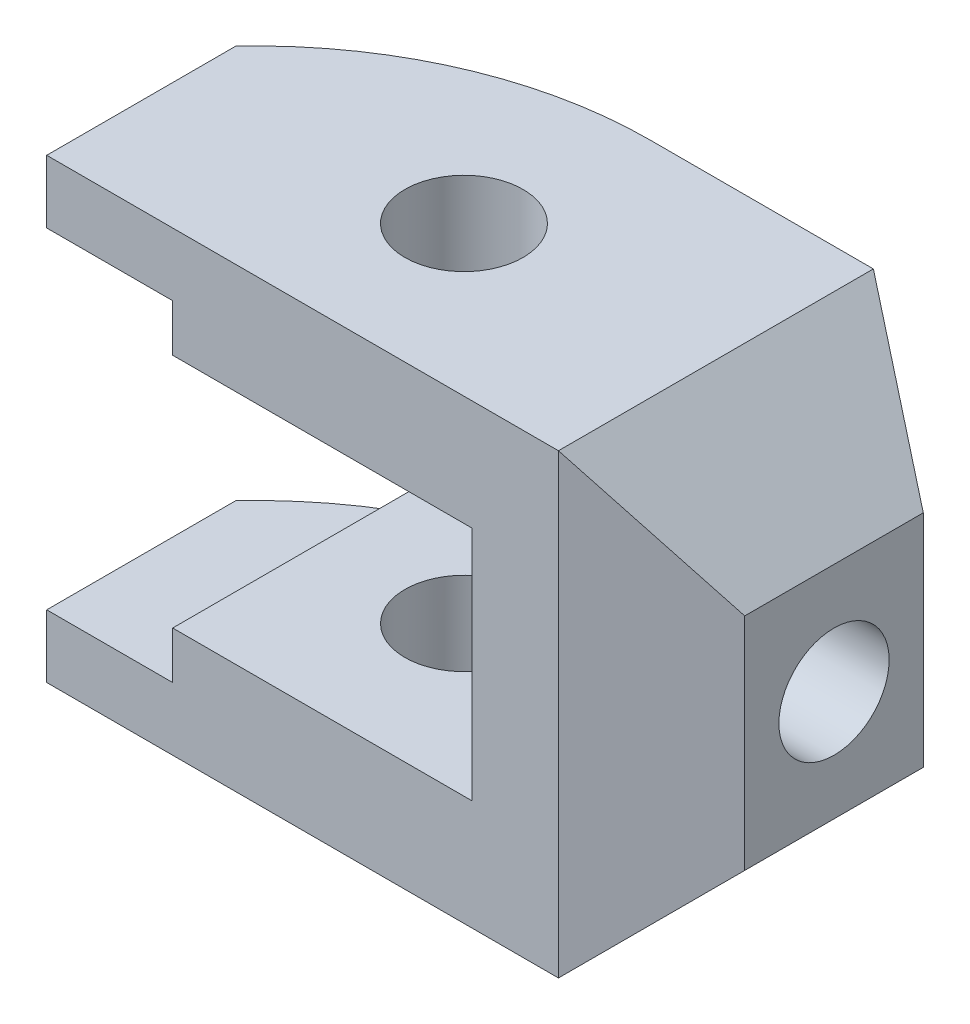
ISO-10303-21;
HEADER;
FILE_DESCRIPTION(('STEP AP214'),'2;1');
FILE_NAME('part.step','',(''),(''),'','','');
FILE_SCHEMA(('AUTOMOTIVE_DESIGN { 1 0 10303 214 1 1 1 1 }'));
ENDSEC;
DATA;
#1=APPLICATION_CONTEXT('core data for automotive mechanical design processes');
#2=APPLICATION_PROTOCOL_DEFINITION('international standard','automotive_design',2000,#1);
#3=PRODUCT_CONTEXT('',#1,'mechanical');
#4=PRODUCT('Part','Part','',(#3));
#5=PRODUCT_RELATED_PRODUCT_CATEGORY('part','',(#4));
#6=PRODUCT_DEFINITION_FORMATION('','',#4);
#7=PRODUCT_DEFINITION_CONTEXT('part definition',#1,'design');
#8=PRODUCT_DEFINITION('design','',#6,#7);
#9=PRODUCT_DEFINITION_SHAPE('','',#8);
#10=(LENGTH_UNIT() NAMED_UNIT(*) SI_UNIT(.MILLI.,.METRE.));
#11=(NAMED_UNIT(*) PLANE_ANGLE_UNIT() SI_UNIT($,.RADIAN.));
#12=(NAMED_UNIT(*) SI_UNIT($,.STERADIAN.) SOLID_ANGLE_UNIT());
#13=UNCERTAINTY_MEASURE_WITH_UNIT(LENGTH_MEASURE(1.E-05),#10,'distance_accuracy_value','');
#14=(GEOMETRIC_REPRESENTATION_CONTEXT(3) GLOBAL_UNCERTAINTY_ASSIGNED_CONTEXT((#13)) GLOBAL_UNIT_ASSIGNED_CONTEXT((#10,
#11,#12)) REPRESENTATION_CONTEXT('',''));
#15=CARTESIAN_POINT('',(0.,0.,0.));
#16=DIRECTION('',(0.,0.,1.));
#17=DIRECTION('',(1.,0.,0.));
#18=AXIS2_PLACEMENT_3D('',#15,#16,#17);
#19=CARTESIAN_POINT('',(2.66060555964672,58.,29.));
#20=DIRECTION('',(0.,-1.,0.));
#21=DIRECTION('',(0.,0.,-1.));
#22=AXIS2_PLACEMENT_3D('',#19,#20,#21);
#23=CYLINDRICAL_SURFACE('',#22,50.);
#24=DIRECTION('',(0.,-1.,0.));
#25=VECTOR('',#24,1.);
#26=CARTESIAN_POINT('',(-18.,58.,-16.5317403347236));
#27=LINE('',#26,#25);
#28=CARTESIAN_POINT('',(-18.,44.,-16.5317403347236));
#29=VERTEX_POINT('',#28);
#30=CARTESIAN_POINT('',(-18.,50.,-16.5317403347236));
#31=VERTEX_POINT('',#30);
#32=EDGE_CURVE('E198',#29,#31,#27,.F.);
#33=ORIENTED_EDGE('',*,*,#32,.T.);
#34=CARTESIAN_POINT('',(2.66060555964672,50.,29.));
#35=DIRECTION('',(0.,1.,0.));
#36=DIRECTION('',(0.,0.,1.));
#37=AXIS2_PLACEMENT_3D('',#34,#35,#36);
#38=CIRCLE('',#37,50.);
#39=CARTESIAN_POINT('',(-34.,50.,-5.));
#40=VERTEX_POINT('',#39);
#41=EDGE_CURVE('E201',#31,#40,#38,.T.);
#42=ORIENTED_EDGE('',*,*,#41,.T.);
#43=DIRECTION('',(0.,-1.,0.));
#44=VECTOR('',#43,1.);
#45=CARTESIAN_POINT('',(-34.,58.,-5.));
#46=LINE('',#45,#44);
#47=CARTESIAN_POINT('',(-34.,58.,-5.));
#48=VERTEX_POINT('',#47);
#49=EDGE_CURVE('E262',#48,#40,#46,.T.);
#50=ORIENTED_EDGE('',*,*,#49,.F.);
#51=CARTESIAN_POINT('',(2.66060555964672,58.,29.));
#52=DIRECTION('',(0.,1.,0.));
#53=DIRECTION('',(0.,0.,1.));
#54=AXIS2_PLACEMENT_3D('',#51,#52,#53);
#55=CIRCLE('',#54,50.);
#56=CARTESIAN_POINT('',(2.66060555964672,58.,-21.));
#57=VERTEX_POINT('',#56);
#58=EDGE_CURVE('E231',#57,#48,#55,.T.);
#59=ORIENTED_EDGE('',*,*,#58,.F.);
#60=DIRECTION('',(0.,-1.,0.));
#61=VECTOR('',#60,1.);
#62=CARTESIAN_POINT('',(2.66060555964672,58.,-21.));
#63=LINE('',#62,#61);
#64=CARTESIAN_POINT('',(2.66060555964672,44.,-21.));
#65=VERTEX_POINT('',#64);
#66=EDGE_CURVE('E265',#57,#65,#63,.T.);
#67=ORIENTED_EDGE('',*,*,#66,.T.);
#68=CARTESIAN_POINT('',(2.66060555964672,44.,29.));
#69=DIRECTION('',(0.,1.,0.));
#70=DIRECTION('',(0.,0.,1.));
#71=AXIS2_PLACEMENT_3D('',#68,#69,#70);
#72=CIRCLE('',#71,50.);
#73=EDGE_CURVE('E187',#65,#29,#72,.T.);
#74=ORIENTED_EDGE('',*,*,#73,.T.);
#75=EDGE_LOOP('',(#33,#42,#50,#59,#67,#74));
#76=FACE_BOUND('',#75,.T.);
#77=ADVANCED_FACE('F36',(#76),#23,.T.);
#78=CARTESIAN_POINT('',(-34.,58.,19.));
#79=DIRECTION('',(1.,0.,0.));
#80=DIRECTION('',(0.,0.,-1.));
#81=AXIS2_PLACEMENT_3D('',#78,#79,#80);
#82=PLANE('',#81);
#83=ORIENTED_EDGE('',*,*,#49,.T.);
#84=DIRECTION('',(0.,0.,1.));
#85=VECTOR('',#84,1.);
#86=CARTESIAN_POINT('',(-34.,50.,-45.));
#87=LINE('',#86,#85);
#88=CARTESIAN_POINT('',(-34.,50.,19.));
#89=VERTEX_POINT('',#88);
#90=EDGE_CURVE('E280',#40,#89,#87,.T.);
#91=ORIENTED_EDGE('',*,*,#90,.T.);
#92=DIRECTION('',(0.,-1.,0.));
#93=VECTOR('',#92,1.);
#94=CARTESIAN_POINT('',(-34.,58.,19.));
#95=LINE('',#94,#93);
#96=CARTESIAN_POINT('',(-34.,58.,19.));
#97=VERTEX_POINT('',#96);
#98=EDGE_CURVE('E258',#97,#89,#95,.T.);
#99=ORIENTED_EDGE('',*,*,#98,.F.);
#100=DIRECTION('',(0.,0.,1.));
#101=VECTOR('',#100,1.);
#102=CARTESIAN_POINT('',(-34.,58.,19.));
#103=LINE('',#102,#101);
#104=EDGE_CURVE('E234',#48,#97,#103,.T.);
#105=ORIENTED_EDGE('',*,*,#104,.F.);
#106=EDGE_LOOP('',(#83,#91,#99,#105));
#107=FACE_BOUND('',#106,.T.);
#108=ADVANCED_FACE('F347',(#107),#82,.F.);
#109=CARTESIAN_POINT('',(0.,58.,0.));
#110=DIRECTION('',(0.,-1.,0.));
#111=DIRECTION('',(0.,0.,-1.));
#112=AXIS2_PLACEMENT_3D('',#109,#110,#111);
#113=CYLINDRICAL_SURFACE('',#112,7.5);
#114=CARTESIAN_POINT('',(0.,44.,0.));
#115=DIRECTION('',(0.,1.,0.));
#116=DIRECTION('',(0.,0.,1.));
#117=AXIS2_PLACEMENT_3D('',#114,#115,#116);
#118=CIRCLE('',#117,7.5);
#119=CARTESIAN_POINT('',(0.,44.,7.5));
#120=VERTEX_POINT('',#119);
#121=EDGE_CURVE('E176',#120,#120,#118,.T.);
#122=ORIENTED_EDGE('',*,*,#121,.F.);
#123=EDGE_LOOP('',(#122));
#124=FACE_BOUND('',#123,.T.);
#125=CARTESIAN_POINT('',(0.,58.,0.));
#126=DIRECTION('',(0.,1.,0.));
#127=DIRECTION('',(0.,0.,1.));
#128=AXIS2_PLACEMENT_3D('',#125,#126,#127);
#129=CIRCLE('',#128,7.5);
#130=CARTESIAN_POINT('',(0.,58.,7.5));
#131=VERTEX_POINT('',#130);
#132=EDGE_CURVE('E223',#131,#131,#129,.T.);
#133=ORIENTED_EDGE('',*,*,#132,.T.);
#134=EDGE_LOOP('',(#133));
#135=FACE_BOUND('',#134,.T.);
#136=ADVANCED_FACE('F356',(#124,#135),#113,.F.);
#137=CARTESIAN_POINT('',(2.66060555964672,58.,29.));
#138=DIRECTION('',(0.,1.,0.));
#139=DIRECTION('',(0.,0.,1.));
#140=AXIS2_PLACEMENT_3D('',#137,#138,#139);
#141=PLANE('',#140);
#142=DIRECTION('',(0.,0.,1.));
#143=VECTOR('',#142,1.);
#144=CARTESIAN_POINT('',(31.,58.,-29.));
#145=LINE('',#144,#143);
#146=CARTESIAN_POINT('',(31.,58.,-21.));
#147=VERTEX_POINT('',#146);
#148=CARTESIAN_POINT('',(31.,58.,19.));
#149=VERTEX_POINT('',#148);
#150=EDGE_CURVE('E207',#147,#149,#145,.T.);
#151=ORIENTED_EDGE('',*,*,#150,.F.);
#152=DIRECTION('',(-1.,0.,0.));
#153=VECTOR('',#152,1.);
#154=CARTESIAN_POINT('',(31.,58.,-21.));
#155=LINE('',#154,#153);
#156=EDGE_CURVE('E229',#147,#57,#155,.T.);
#157=ORIENTED_EDGE('',*,*,#156,.T.);
#158=ORIENTED_EDGE('',*,*,#58,.T.);
#159=ORIENTED_EDGE('',*,*,#104,.T.);
#160=DIRECTION('',(1.,0.,0.));
#161=VECTOR('',#160,1.);
#162=CARTESIAN_POINT('',(0.,58.,19.));
#163=LINE('',#162,#161);
#164=EDGE_CURVE('E236',#97,#149,#163,.T.);
#165=ORIENTED_EDGE('',*,*,#164,.T.);
#166=EDGE_LOOP('',(#151,#157,#158,#159,#165));
#167=FACE_BOUND('',#166,.T.);
#168=ORIENTED_EDGE('',*,*,#132,.F.);
#169=EDGE_LOOP('',(#168));
#170=FACE_BOUND('',#169,.T.);
#171=ADVANCED_FACE('F320',(#167,#170),#141,.T.);
#172=CARTESIAN_POINT('',(2.66060555964672,0.,29.));
#173=DIRECTION('',(0.,1.,0.));
#174=DIRECTION('',(0.,0.,1.));
#175=AXIS2_PLACEMENT_3D('',#172,#173,#174);
#176=PLANE('',#175);
#177=DIRECTION('',(-1.,0.,0.));
#178=VECTOR('',#177,1.);
#179=CARTESIAN_POINT('',(31.,0.,-21.));
#180=LINE('',#179,#178);
#181=CARTESIAN_POINT('',(31.,0.,-21.));
#182=VERTEX_POINT('',#181);
#183=CARTESIAN_POINT('',(2.66060555964672,0.,-21.));
#184=VERTEX_POINT('',#183);
#185=EDGE_CURVE('E226',#182,#184,#180,.T.);
#186=ORIENTED_EDGE('',*,*,#185,.F.);
#187=DIRECTION('',(0.,0.,1.));
#188=VECTOR('',#187,1.);
#189=CARTESIAN_POINT('',(31.,0.,-29.));
#190=LINE('',#189,#188);
#191=CARTESIAN_POINT('',(31.,0.,19.));
#192=VERTEX_POINT('',#191);
#193=EDGE_CURVE('E208',#182,#192,#190,.T.);
#194=ORIENTED_EDGE('',*,*,#193,.T.);
#195=DIRECTION('',(1.,0.,0.));
#196=VECTOR('',#195,1.);
#197=CARTESIAN_POINT('',(0.,0.,19.));
#198=LINE('',#197,#196);
#199=CARTESIAN_POINT('',(-34.,0.,19.));
#200=VERTEX_POINT('',#199);
#201=EDGE_CURVE('E232',#200,#192,#198,.T.);
#202=ORIENTED_EDGE('',*,*,#201,.F.);
#203=DIRECTION('',(0.,0.,1.));
#204=VECTOR('',#203,1.);
#205=CARTESIAN_POINT('',(-34.,0.,19.));
#206=LINE('',#205,#204);
#207=CARTESIAN_POINT('',(-34.,0.,-5.));
#208=VERTEX_POINT('',#207);
#209=EDGE_CURVE('E244',#208,#200,#206,.T.);
#210=ORIENTED_EDGE('',*,*,#209,.F.);
#211=CARTESIAN_POINT('',(2.66060555964672,0.,29.));
#212=DIRECTION('',(0.,1.,0.));
#213=DIRECTION('',(0.,0.,1.));
#214=AXIS2_PLACEMENT_3D('',#211,#212,#213);
#215=CIRCLE('',#214,50.);
#216=EDGE_CURVE('E241',#184,#208,#215,.T.);
#217=ORIENTED_EDGE('',*,*,#216,.F.);
#218=EDGE_LOOP('',(#186,#194,#202,#210,#217));
#219=FACE_BOUND('',#218,.T.);
#220=CARTESIAN_POINT('',(0.,0.,0.));
#221=DIRECTION('',(0.,1.,0.));
#222=DIRECTION('',(0.,0.,1.));
#223=AXIS2_PLACEMENT_3D('',#220,#221,#222);
#224=CIRCLE('',#223,7.5);
#225=CARTESIAN_POINT('',(0.,0.,7.5));
#226=VERTEX_POINT('',#225);
#227=EDGE_CURVE('E222',#226,#226,#224,.T.);
#228=ORIENTED_EDGE('',*,*,#227,.T.);
#229=EDGE_LOOP('',(#228));
#230=FACE_BOUND('',#229,.T.);
#231=ADVANCED_FACE('F330',(#219,#230),#176,.F.);
#232=CARTESIAN_POINT('',(46.,58.,-12.3397459621557));
#233=DIRECTION('',(-0.499999999999995,0.,0.866025403784442));
#234=DIRECTION('',(0.866025403784442,0.,0.499999999999995));
#235=AXIS2_PLACEMENT_3D('',#232,#233,#234);
#236=PLANE('',#235);
#237=DIRECTION('',(0.,-1.,0.));
#238=VECTOR('',#237,1.);
#239=CARTESIAN_POINT('',(46.,58.,-12.3397459621557));
#240=LINE('',#239,#238);
#241=CARTESIAN_POINT('',(46.,43.0000000000002,-12.3397459621557));
#242=VERTEX_POINT('',#241);
#243=CARTESIAN_POINT('',(46.,14.9999999999999,-12.3397459621557));
#244=VERTEX_POINT('',#243);
#245=EDGE_CURVE('E239',#242,#244,#240,.T.);
#246=ORIENTED_EDGE('',*,*,#245,.T.);
#247=DIRECTION('',(-0.654653670707981,-0.654653670707975,-0.377964473009224));
#248=VECTOR('',#247,1.);
#249=CARTESIAN_POINT('',(64.4285714285715,33.4285714285712,-1.70000528708986));
#250=LINE('',#249,#248);
#251=EDGE_CURVE('E219',#244,#182,#250,.T.);
#252=ORIENTED_EDGE('',*,*,#251,.T.);
#253=DIRECTION('',(0.,-1.,0.));
#254=VECTOR('',#253,1.);
#255=CARTESIAN_POINT('',(31.,58.,-21.));
#256=LINE('',#255,#254);
#257=EDGE_CURVE('E268',#147,#182,#256,.T.);
#258=ORIENTED_EDGE('',*,*,#257,.F.);
#259=DIRECTION('',(0.654653670707981,-0.654653670707975,0.377964473009224));
#260=VECTOR('',#259,1.);
#261=CARTESIAN_POINT('',(39.5714285714286,49.4285714285715,-16.0512834069461));
#262=LINE('',#261,#260);
#263=EDGE_CURVE('E213',#147,#242,#262,.T.);
#264=ORIENTED_EDGE('',*,*,#263,.T.);
#265=EDGE_LOOP('',(#246,#252,#258,#264));
#266=FACE_BOUND('',#265,.T.);
#267=ADVANCED_FACE('F38',(#266),#236,.F.);
#268=CARTESIAN_POINT('',(31.,58.,-21.));
#269=DIRECTION('',(0.,0.,1.));
#270=DIRECTION('',(1.,0.,0.));
#271=AXIS2_PLACEMENT_3D('',#268,#269,#270);
#272=PLANE('',#271);
#273=DIRECTION('',(0.,1.,0.));
#274=VECTOR('',#273,1.);
#275=CARTESIAN_POINT('',(20.,58.,-21.));
#276=LINE('',#275,#274);
#277=CARTESIAN_POINT('',(20.,14.,-21.));
#278=VERTEX_POINT('',#277);
#279=CARTESIAN_POINT('',(20.,44.,-21.));
#280=VERTEX_POINT('',#279);
#281=EDGE_CURVE('E150',#278,#280,#276,.T.);
#282=ORIENTED_EDGE('',*,*,#281,.T.);
#283=DIRECTION('',(-1.,0.,0.));
#284=VECTOR('',#283,1.);
#285=CARTESIAN_POINT('',(31.,44.,-21.));
#286=LINE('',#285,#284);
#287=EDGE_CURVE('E190',#280,#65,#286,.T.);
#288=ORIENTED_EDGE('',*,*,#287,.T.);
#289=ORIENTED_EDGE('',*,*,#66,.F.);
#290=ORIENTED_EDGE('',*,*,#156,.F.);
#291=ORIENTED_EDGE('',*,*,#257,.T.);
#292=ORIENTED_EDGE('',*,*,#185,.T.);
#293=CARTESIAN_POINT('',(2.66060555964672,14.,-21.));
#294=VERTEX_POINT('',#293);
#295=EDGE_CURVE('E175',#294,#184,#63,.T.);
#296=ORIENTED_EDGE('',*,*,#295,.F.);
#297=DIRECTION('',(1.,0.,0.));
#298=VECTOR('',#297,1.);
#299=CARTESIAN_POINT('',(31.,14.,-21.));
#300=LINE('',#299,#298);
#301=EDGE_CURVE('E165',#294,#278,#300,.T.);
#302=ORIENTED_EDGE('',*,*,#301,.T.);
#303=EDGE_LOOP('',(#282,#288,#289,#290,#291,#292,#296,#302));
#304=FACE_BOUND('',#303,.T.);
#305=ADVANCED_FACE('F173',(#304),#272,.F.);
#306=DIRECTION('',(0.,-1.,0.));
#307=VECTOR('',#306,1.);
#308=CARTESIAN_POINT('',(-18.,58.,-16.5317403347236));
#309=LINE('',#308,#307);
#310=CARTESIAN_POINT('',(-18.,8.00000000000002,-16.5317403347236));
#311=VERTEX_POINT('',#310);
#312=CARTESIAN_POINT('',(-18.,14.,-16.5317403347236));
#313=VERTEX_POINT('',#312);
#314=EDGE_CURVE('E195',#311,#313,#309,.F.);
#315=ORIENTED_EDGE('',*,*,#314,.T.);
#316=CARTESIAN_POINT('',(2.66060555964672,14.,29.));
#317=DIRECTION('',(0.,-1.,0.));
#318=DIRECTION('',(1.,0.,0.));
#319=AXIS2_PLACEMENT_3D('',#316,#317,#318);
#320=CIRCLE('',#319,50.);
#321=EDGE_CURVE('E177',#313,#294,#320,.T.);
#322=ORIENTED_EDGE('',*,*,#321,.T.);
#323=ORIENTED_EDGE('',*,*,#295,.T.);
#324=ORIENTED_EDGE('',*,*,#216,.T.);
#325=CARTESIAN_POINT('',(-34.,8.00000000000002,-5.));
#326=VERTEX_POINT('',#325);
#327=EDGE_CURVE('E261',#326,#208,#46,.T.);
#328=ORIENTED_EDGE('',*,*,#327,.F.);
#329=CARTESIAN_POINT('',(2.66060555964672,8.00000000000002,29.));
#330=DIRECTION('',(0.,-1.,0.));
#331=DIRECTION('',(0.,0.,-1.));
#332=AXIS2_PLACEMENT_3D('',#329,#330,#331);
#333=CIRCLE('',#332,50.);
#334=EDGE_CURVE('E192',#326,#311,#333,.T.);
#335=ORIENTED_EDGE('',*,*,#334,.T.);
#336=EDGE_LOOP('',(#315,#322,#323,#324,#328,#335));
#337=FACE_BOUND('',#336,.T.);
#338=ADVANCED_FACE('F336',(#337),#23,.T.);
#339=CARTESIAN_POINT('',(-34.,8.00000000000004,19.));
#340=VERTEX_POINT('',#339);
#341=EDGE_CURVE('E257',#340,#200,#95,.T.);
#342=ORIENTED_EDGE('',*,*,#341,.F.);
#343=DIRECTION('',(0.,0.,1.));
#344=VECTOR('',#343,1.);
#345=CARTESIAN_POINT('',(-34.,8.00000000000002,-45.));
#346=LINE('',#345,#344);
#347=EDGE_CURVE('E51',#326,#340,#346,.T.);
#348=ORIENTED_EDGE('',*,*,#347,.F.);
#349=ORIENTED_EDGE('',*,*,#327,.T.);
#350=ORIENTED_EDGE('',*,*,#209,.T.);
#351=EDGE_LOOP('',(#342,#348,#349,#350));
#352=FACE_BOUND('',#351,.T.);
#353=ADVANCED_FACE('F344',(#352),#82,.F.);
#354=CARTESIAN_POINT('',(0.,58.,19.));
#355=DIRECTION('',(0.,0.,-1.));
#356=DIRECTION('',(-1.,0.,0.));
#357=AXIS2_PLACEMENT_3D('',#354,#355,#356);
#358=PLANE('',#357);
#359=ORIENTED_EDGE('',*,*,#98,.T.);
#360=DIRECTION('',(1.,0.,0.));
#361=VECTOR('',#360,1.);
#362=CARTESIAN_POINT('',(0.,50.,19.));
#363=LINE('',#362,#361);
#364=CARTESIAN_POINT('',(-18.,50.,19.));
#365=VERTEX_POINT('',#364);
#366=EDGE_CURVE('E11',#89,#365,#363,.T.);
#367=ORIENTED_EDGE('',*,*,#366,.T.);
#368=DIRECTION('',(0.,-1.,0.));
#369=VECTOR('',#368,1.);
#370=CARTESIAN_POINT('',(-18.,58.,19.));
#371=LINE('',#370,#369);
#372=CARTESIAN_POINT('',(-18.,44.,19.));
#373=VERTEX_POINT('',#372);
#374=EDGE_CURVE('E44',#365,#373,#371,.T.);
#375=ORIENTED_EDGE('',*,*,#374,.T.);
#376=DIRECTION('',(1.,0.,0.));
#377=VECTOR('',#376,1.);
#378=CARTESIAN_POINT('',(0.,44.,19.));
#379=LINE('',#378,#377);
#380=CARTESIAN_POINT('',(20.,44.,19.));
#381=VERTEX_POINT('',#380);
#382=EDGE_CURVE('E180',#373,#381,#379,.T.);
#383=ORIENTED_EDGE('',*,*,#382,.T.);
#384=DIRECTION('',(0.,-1.,0.));
#385=VECTOR('',#384,1.);
#386=CARTESIAN_POINT('',(20.,58.,19.));
#387=LINE('',#386,#385);
#388=CARTESIAN_POINT('',(20.,14.,19.));
#389=VERTEX_POINT('',#388);
#390=EDGE_CURVE('E161',#381,#389,#387,.T.);
#391=ORIENTED_EDGE('',*,*,#390,.T.);
#392=DIRECTION('',(-1.,0.,0.));
#393=VECTOR('',#392,1.);
#394=CARTESIAN_POINT('',(0.,14.,19.));
#395=LINE('',#394,#393);
#396=CARTESIAN_POINT('',(-18.,14.,19.));
#397=VERTEX_POINT('',#396);
#398=EDGE_CURVE('E169',#389,#397,#395,.T.);
#399=ORIENTED_EDGE('',*,*,#398,.T.);
#400=DIRECTION('',(0.,-1.,0.));
#401=VECTOR('',#400,1.);
#402=CARTESIAN_POINT('',(-18.,58.,19.));
#403=LINE('',#402,#401);
#404=CARTESIAN_POINT('',(-18.,8.00000000000002,19.));
#405=VERTEX_POINT('',#404);
#406=EDGE_CURVE('E284',#397,#405,#403,.T.);
#407=ORIENTED_EDGE('',*,*,#406,.T.);
#408=DIRECTION('',(-1.,0.,0.));
#409=VECTOR('',#408,1.);
#410=CARTESIAN_POINT('',(0.,8.00000000000002,19.));
#411=LINE('',#410,#409);
#412=EDGE_CURVE('E276',#405,#340,#411,.T.);
#413=ORIENTED_EDGE('',*,*,#412,.T.);
#414=ORIENTED_EDGE('',*,*,#341,.T.);
#415=ORIENTED_EDGE('',*,*,#201,.T.);
#416=DIRECTION('',(0.,-1.,0.));
#417=VECTOR('',#416,1.);
#418=CARTESIAN_POINT('',(31.,58.,19.));
#419=LINE('',#418,#417);
#420=EDGE_CURVE('E254',#149,#192,#419,.T.);
#421=ORIENTED_EDGE('',*,*,#420,.F.);
#422=ORIENTED_EDGE('',*,*,#164,.F.);
#423=EDGE_LOOP('',(#359,#367,#375,#383,#391,#399,#407,#413,#414,#415,#421,#422));
#424=FACE_BOUND('',#423,.T.);
#425=ADVANCED_FACE('F288',(#424),#358,.F.);
#426=CARTESIAN_POINT('',(31.,58.,19.));
#427=DIRECTION('',(-0.500000000000001,0.,-0.866025403784438));
#428=DIRECTION('',(-0.866025403784438,0.,0.500000000000001));
#429=AXIS2_PLACEMENT_3D('',#426,#427,#428);
#430=PLANE('',#429);
#431=ORIENTED_EDGE('',*,*,#420,.T.);
#432=DIRECTION('',(0.65465367070798,0.654653670707973,-0.37796447300923));
#433=VECTOR('',#432,1.);
#434=CARTESIAN_POINT('',(55.8571428571428,24.8571428571425,4.64872188014358));
#435=LINE('',#434,#433);
#436=CARTESIAN_POINT('',(46.,14.9999999999998,10.3397459621556));
#437=VERTEX_POINT('',#436);
#438=EDGE_CURVE('E216',#192,#437,#435,.T.);
#439=ORIENTED_EDGE('',*,*,#438,.T.);
#440=DIRECTION('',(0.,-1.,0.));
#441=VECTOR('',#440,1.);
#442=CARTESIAN_POINT('',(46.,58.,10.3397459621556));
#443=LINE('',#442,#441);
#444=CARTESIAN_POINT('',(46.,43.0000000000002,10.3397459621556));
#445=VERTEX_POINT('',#444);
#446=EDGE_CURVE('E251',#445,#437,#443,.T.);
#447=ORIENTED_EDGE('',*,*,#446,.F.);
#448=DIRECTION('',(-0.65465367070798,0.654653670707973,0.37796447300923));
#449=VECTOR('',#448,1.);
#450=CARTESIAN_POINT('',(31.,58.,19.));
#451=LINE('',#450,#449);
#452=EDGE_CURVE('E59',#445,#149,#451,.T.);
#453=ORIENTED_EDGE('',*,*,#452,.T.);
#454=EDGE_LOOP('',(#431,#439,#447,#453));
#455=FACE_BOUND('',#454,.T.);
#456=ADVANCED_FACE('F352',(#455),#430,.F.);
#457=CARTESIAN_POINT('',(46.,58.,10.3397459621556));
#458=DIRECTION('',(-1.,0.,0.));
#459=DIRECTION('',(0.,0.,1.));
#460=AXIS2_PLACEMENT_3D('',#457,#458,#459);
#461=PLANE('',#460);
#462=CARTESIAN_POINT('',(46.,29.,-1.));
#463=DIRECTION('',(-1.,0.,0.));
#464=DIRECTION('',(0.,0.,1.));
#465=AXIS2_PLACEMENT_3D('',#462,#463,#464);
#466=CIRCLE('',#465,7.);
#467=CARTESIAN_POINT('',(46.,29.,6.));
#468=VERTEX_POINT('',#467);
#469=EDGE_CURVE('E204',#468,#468,#466,.T.);
#470=ORIENTED_EDGE('',*,*,#469,.T.);
#471=EDGE_LOOP('',(#470));
#472=FACE_BOUND('',#471,.T.);
#473=ORIENTED_EDGE('',*,*,#446,.T.);
#474=DIRECTION('',(0.,0.,-1.));
#475=VECTOR('',#474,1.);
#476=CARTESIAN_POINT('',(46.,14.9999999999998,10.3397459621556));
#477=LINE('',#476,#475);
#478=EDGE_CURVE('E273',#437,#244,#477,.T.);
#479=ORIENTED_EDGE('',*,*,#478,.T.);
#480=ORIENTED_EDGE('',*,*,#245,.F.);
#481=DIRECTION('',(0.,0.,1.));
#482=VECTOR('',#481,1.);
#483=CARTESIAN_POINT('',(46.,43.0000000000002,10.3397459621556));
#484=LINE('',#483,#482);
#485=EDGE_CURVE('E271',#242,#445,#484,.T.);
#486=ORIENTED_EDGE('',*,*,#485,.T.);
#487=EDGE_LOOP('',(#473,#479,#480,#486));
#488=FACE_BOUND('',#487,.T.);
#489=ADVANCED_FACE('F378',(#472,#488),#461,.F.);
#490=CARTESIAN_POINT('',(0.,14.,0.));
#491=DIRECTION('',(0.,-1.,0.));
#492=DIRECTION('',(1.,0.,0.));
#493=AXIS2_PLACEMENT_3D('',#490,#491,#492);
#494=CIRCLE('',#493,7.5);
#495=CARTESIAN_POINT('',(7.5,14.,0.));
#496=VERTEX_POINT('',#495);
#497=EDGE_CURVE('E160',#496,#496,#494,.T.);
#498=ORIENTED_EDGE('',*,*,#497,.F.);
#499=EDGE_LOOP('',(#498));
#500=FACE_BOUND('',#499,.T.);
#501=ORIENTED_EDGE('',*,*,#227,.F.);
#502=EDGE_LOOP('',(#501));
#503=FACE_BOUND('',#502,.T.);
#504=ADVANCED_FACE('F380',(#500,#503),#113,.F.);
#505=CARTESIAN_POINT('',(31.,58.,-29.));
#506=DIRECTION('',(-0.707106781186544,-0.707106781186551,0.));
#507=DIRECTION('',(0.707106781186551,-0.707106781186544,0.));
#508=AXIS2_PLACEMENT_3D('',#505,#506,#507);
#509=PLANE('',#508);
#510=ORIENTED_EDGE('',*,*,#150,.T.);
#511=ORIENTED_EDGE('',*,*,#452,.F.);
#512=ORIENTED_EDGE('',*,*,#485,.F.);
#513=ORIENTED_EDGE('',*,*,#263,.F.);
#514=EDGE_LOOP('',(#510,#511,#512,#513));
#515=FACE_BOUND('',#514,.T.);
#516=ADVANCED_FACE('F390',(#515),#509,.F.);
#517=CARTESIAN_POINT('',(31.,0.,-29.));
#518=DIRECTION('',(-0.707106781186544,0.707106781186551,0.));
#519=DIRECTION('',(-0.707106781186551,-0.707106781186544,0.));
#520=AXIS2_PLACEMENT_3D('',#517,#518,#519);
#521=PLANE('',#520);
#522=ORIENTED_EDGE('',*,*,#478,.F.);
#523=ORIENTED_EDGE('',*,*,#438,.F.);
#524=ORIENTED_EDGE('',*,*,#193,.F.);
#525=ORIENTED_EDGE('',*,*,#251,.F.);
#526=EDGE_LOOP('',(#522,#523,#524,#525));
#527=FACE_BOUND('',#526,.T.);
#528=ADVANCED_FACE('F392',(#527),#521,.F.);
#529=CARTESIAN_POINT('',(-64.,29.,-1.));
#530=DIRECTION('',(1.,0.,0.));
#531=DIRECTION('',(0.,0.,-1.));
#532=AXIS2_PLACEMENT_3D('',#529,#530,#531);
#533=CYLINDRICAL_SURFACE('',#532,7.);
#534=CARTESIAN_POINT('',(20.,29.,-1.));
#535=DIRECTION('',(1.,0.,0.));
#536=DIRECTION('',(0.,0.,-1.));
#537=AXIS2_PLACEMENT_3D('',#534,#535,#536);
#538=CIRCLE('',#537,7.);
#539=CARTESIAN_POINT('',(20.,29.,-8.));
#540=VERTEX_POINT('',#539);
#541=EDGE_CURVE('E277',#540,#540,#538,.F.);
#542=ORIENTED_EDGE('',*,*,#541,.T.);
#543=EDGE_LOOP('',(#542));
#544=FACE_BOUND('',#543,.T.);
#545=ORIENTED_EDGE('',*,*,#469,.F.);
#546=EDGE_LOOP('',(#545));
#547=FACE_BOUND('',#546,.T.);
#548=ADVANCED_FACE('F397',(#544,#547),#533,.F.);
#549=CARTESIAN_POINT('',(-34.,50.,-45.));
#550=DIRECTION('',(0.,1.,0.));
#551=DIRECTION('',(0.,0.,1.));
#552=AXIS2_PLACEMENT_3D('',#549,#550,#551);
#553=PLANE('',#552);
#554=DIRECTION('',(0.,0.,1.));
#555=VECTOR('',#554,1.);
#556=CARTESIAN_POINT('',(-18.,50.,-45.));
#557=LINE('',#556,#555);
#558=EDGE_CURVE('E294',#31,#365,#557,.T.);
#559=ORIENTED_EDGE('',*,*,#558,.T.);
#560=ORIENTED_EDGE('',*,*,#366,.F.);
#561=ORIENTED_EDGE('',*,*,#90,.F.);
#562=ORIENTED_EDGE('',*,*,#41,.F.);
#563=EDGE_LOOP('',(#559,#560,#561,#562));
#564=FACE_BOUND('',#563,.T.);
#565=ADVANCED_FACE('F298',(#564),#553,.F.);
#566=CARTESIAN_POINT('',(-18.,50.,-45.));
#567=DIRECTION('',(1.,0.,0.));
#568=DIRECTION('',(0.,0.,-1.));
#569=AXIS2_PLACEMENT_3D('',#566,#567,#568);
#570=PLANE('',#569);
#571=DIRECTION('',(0.,0.,1.));
#572=VECTOR('',#571,1.);
#573=CARTESIAN_POINT('',(-18.,44.,-45.));
#574=LINE('',#573,#572);
#575=EDGE_CURVE('E296',#29,#373,#574,.T.);
#576=ORIENTED_EDGE('',*,*,#575,.T.);
#577=ORIENTED_EDGE('',*,*,#374,.F.);
#578=ORIENTED_EDGE('',*,*,#558,.F.);
#579=ORIENTED_EDGE('',*,*,#32,.F.);
#580=EDGE_LOOP('',(#576,#577,#578,#579));
#581=FACE_BOUND('',#580,.T.);
#582=ADVANCED_FACE('F293',(#581),#570,.F.);
#583=CARTESIAN_POINT('',(-18.,8.00000000000002,-45.));
#584=DIRECTION('',(1.,0.,0.));
#585=DIRECTION('',(0.,0.,-1.));
#586=AXIS2_PLACEMENT_3D('',#583,#584,#585);
#587=PLANE('',#586);
#588=DIRECTION('',(0.,0.,1.));
#589=VECTOR('',#588,1.);
#590=CARTESIAN_POINT('',(-18.,8.00000000000002,-45.));
#591=LINE('',#590,#589);
#592=EDGE_CURVE('E306',#311,#405,#591,.T.);
#593=ORIENTED_EDGE('',*,*,#592,.T.);
#594=ORIENTED_EDGE('',*,*,#406,.F.);
#595=DIRECTION('',(0.,0.,1.));
#596=VECTOR('',#595,1.);
#597=CARTESIAN_POINT('',(-18.,14.,-45.));
#598=LINE('',#597,#596);
#599=EDGE_CURVE('E170',#313,#397,#598,.T.);
#600=ORIENTED_EDGE('',*,*,#599,.F.);
#601=ORIENTED_EDGE('',*,*,#314,.F.);
#602=EDGE_LOOP('',(#593,#594,#600,#601));
#603=FACE_BOUND('',#602,.T.);
#604=ADVANCED_FACE('F339',(#603),#587,.F.);
#605=CARTESIAN_POINT('',(-34.,8.00000000000002,-45.));
#606=DIRECTION('',(0.,-1.,0.));
#607=DIRECTION('',(0.,0.,-1.));
#608=AXIS2_PLACEMENT_3D('',#605,#606,#607);
#609=PLANE('',#608);
#610=ORIENTED_EDGE('',*,*,#347,.T.);
#611=ORIENTED_EDGE('',*,*,#412,.F.);
#612=ORIENTED_EDGE('',*,*,#592,.F.);
#613=ORIENTED_EDGE('',*,*,#334,.F.);
#614=EDGE_LOOP('',(#610,#611,#612,#613));
#615=FACE_BOUND('',#614,.T.);
#616=ADVANCED_FACE('F341',(#615),#609,.F.);
#617=CARTESIAN_POINT('',(-18.,44.,-45.));
#618=DIRECTION('',(0.,1.,0.));
#619=DIRECTION('',(0.,0.,1.));
#620=AXIS2_PLACEMENT_3D('',#617,#618,#619);
#621=PLANE('',#620);
#622=ORIENTED_EDGE('',*,*,#121,.T.);
#623=EDGE_LOOP('',(#622));
#624=FACE_BOUND('',#623,.T.);
#625=DIRECTION('',(0.,0.,1.));
#626=VECTOR('',#625,1.);
#627=CARTESIAN_POINT('',(20.,44.,-45.));
#628=LINE('',#627,#626);
#629=EDGE_CURVE('E156',#280,#381,#628,.T.);
#630=ORIENTED_EDGE('',*,*,#629,.T.);
#631=ORIENTED_EDGE('',*,*,#382,.F.);
#632=ORIENTED_EDGE('',*,*,#575,.F.);
#633=ORIENTED_EDGE('',*,*,#73,.F.);
#634=ORIENTED_EDGE('',*,*,#287,.F.);
#635=EDGE_LOOP('',(#630,#631,#632,#633,#634));
#636=FACE_BOUND('',#635,.T.);
#637=ADVANCED_FACE('F311',(#624,#636),#621,.F.);
#638=CARTESIAN_POINT('',(-18.,14.,-45.));
#639=DIRECTION('',(0.,-1.,0.));
#640=DIRECTION('',(1.,0.,0.));
#641=AXIS2_PLACEMENT_3D('',#638,#639,#640);
#642=PLANE('',#641);
#643=ORIENTED_EDGE('',*,*,#497,.T.);
#644=EDGE_LOOP('',(#643));
#645=FACE_BOUND('',#644,.T.);
#646=ORIENTED_EDGE('',*,*,#321,.F.);
#647=ORIENTED_EDGE('',*,*,#599,.T.);
#648=ORIENTED_EDGE('',*,*,#398,.F.);
#649=DIRECTION('',(0.,0.,1.));
#650=VECTOR('',#649,1.);
#651=CARTESIAN_POINT('',(20.,14.,-45.));
#652=LINE('',#651,#650);
#653=EDGE_CURVE('E153',#278,#389,#652,.T.);
#654=ORIENTED_EDGE('',*,*,#653,.F.);
#655=ORIENTED_EDGE('',*,*,#301,.F.);
#656=EDGE_LOOP('',(#646,#647,#648,#654,#655));
#657=FACE_BOUND('',#656,.T.);
#658=ADVANCED_FACE('F164',(#645,#657),#642,.F.);
#659=CARTESIAN_POINT('',(20.,44.,-45.));
#660=DIRECTION('',(1.,0.,0.));
#661=DIRECTION('',(0.,0.,-1.));
#662=AXIS2_PLACEMENT_3D('',#659,#660,#661);
#663=PLANE('',#662);
#664=ORIENTED_EDGE('',*,*,#541,.F.);
#665=EDGE_LOOP('',(#664));
#666=FACE_BOUND('',#665,.T.);
#667=ORIENTED_EDGE('',*,*,#653,.T.);
#668=ORIENTED_EDGE('',*,*,#390,.F.);
#669=ORIENTED_EDGE('',*,*,#629,.F.);
#670=ORIENTED_EDGE('',*,*,#281,.F.);
#671=EDGE_LOOP('',(#667,#668,#669,#670));
#672=FACE_BOUND('',#671,.T.);
#673=ADVANCED_FACE('F152',(#666,#672),#663,.F.);
#674=CLOSED_SHELL('',(#77,#108,#136,#171,#231,#267,#305,#338,#353,#425,#456,#489,#504,#516,#528,
#548,#565,#582,#604,#616,#637,#658,#673));
#675=MANIFOLD_SOLID_BREP('B2',#674);
#676=ADVANCED_BREP_SHAPE_REPRESENTATION('',(#18,#675),#14);
#677=SHAPE_DEFINITION_REPRESENTATION(#9,#676);
ENDSEC;
END-ISO-10303-21;
